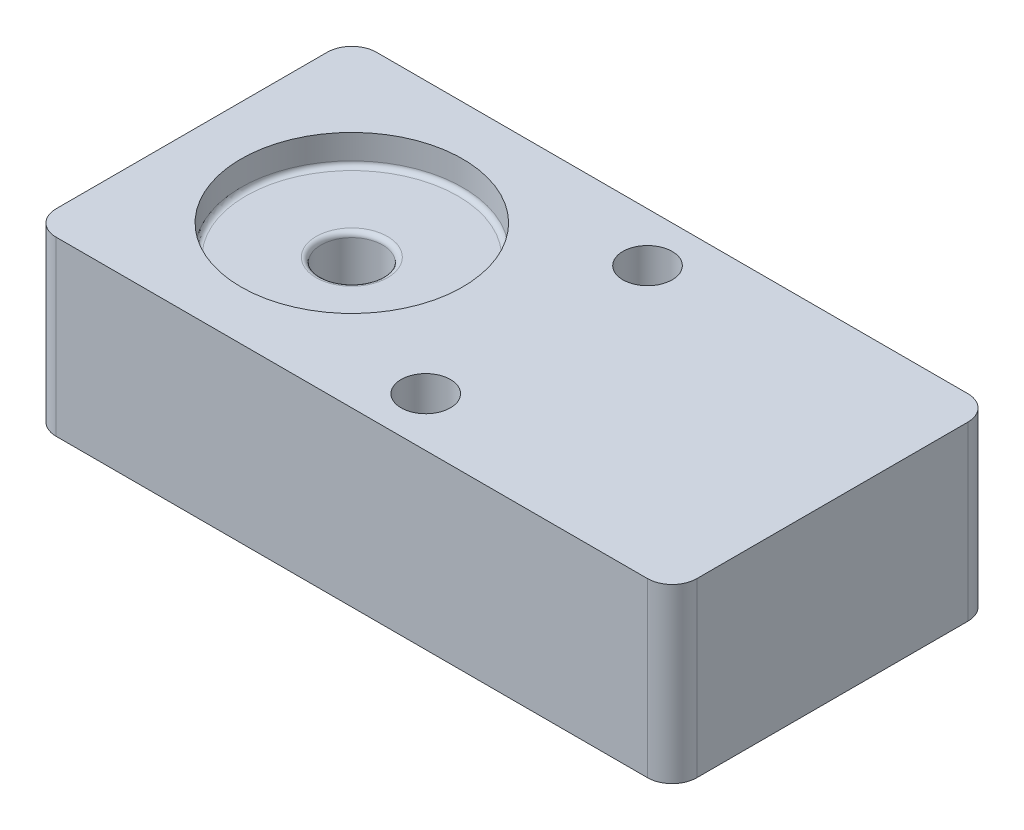
ISO-10303-21;
HEADER;
FILE_DESCRIPTION(('STEP AP214'),'2;1');
FILE_NAME('part.step','',(''),(''),'','','');
FILE_SCHEMA(('AUTOMOTIVE_DESIGN { 1 0 10303 214 1 1 1 1 }'));
ENDSEC;
DATA;
#1=APPLICATION_CONTEXT('core data for automotive mechanical design processes');
#2=APPLICATION_PROTOCOL_DEFINITION('international standard','automotive_design',2000,#1);
#3=PRODUCT_CONTEXT('',#1,'mechanical');
#4=PRODUCT('Part','Part','',(#3));
#5=PRODUCT_RELATED_PRODUCT_CATEGORY('part','',(#4));
#6=PRODUCT_DEFINITION_FORMATION('','',#4);
#7=PRODUCT_DEFINITION_CONTEXT('part definition',#1,'design');
#8=PRODUCT_DEFINITION('design','',#6,#7);
#9=PRODUCT_DEFINITION_SHAPE('','',#8);
#10=(LENGTH_UNIT() NAMED_UNIT(*) SI_UNIT(.MILLI.,.METRE.));
#11=(NAMED_UNIT(*) PLANE_ANGLE_UNIT() SI_UNIT($,.RADIAN.));
#12=(NAMED_UNIT(*) SI_UNIT($,.STERADIAN.) SOLID_ANGLE_UNIT());
#13=UNCERTAINTY_MEASURE_WITH_UNIT(LENGTH_MEASURE(1.E-05),#10,'distance_accuracy_value','');
#14=(GEOMETRIC_REPRESENTATION_CONTEXT(3) GLOBAL_UNCERTAINTY_ASSIGNED_CONTEXT((#13)) GLOBAL_UNIT_ASSIGNED_CONTEXT((#10,
#11,#12)) REPRESENTATION_CONTEXT('',''));
#15=CARTESIAN_POINT('',(0.,0.,0.));
#16=DIRECTION('',(0.,0.,1.));
#17=DIRECTION('',(1.,0.,0.));
#18=AXIS2_PLACEMENT_3D('',#15,#16,#17);
#19=CARTESIAN_POINT('',(120.,70.,-55.));
#20=DIRECTION('',(0.,-1.,0.));
#21=DIRECTION('',(0.,0.,-1.));
#22=AXIS2_PLACEMENT_3D('',#19,#20,#21);
#23=CYLINDRICAL_SURFACE('',#22,10.);
#24=DIRECTION('',(0.,-1.,0.));
#25=VECTOR('',#24,1.);
#26=CARTESIAN_POINT('',(120.,70.,-65.));
#27=LINE('',#26,#25);
#28=CARTESIAN_POINT('',(120.,70.,-65.));
#29=VERTEX_POINT('',#28);
#30=CARTESIAN_POINT('',(120.,0.,-65.));
#31=VERTEX_POINT('',#30);
#32=EDGE_CURVE('E100',#29,#31,#27,.T.);
#33=ORIENTED_EDGE('',*,*,#32,.F.);
#34=CARTESIAN_POINT('',(120.,70.,-55.));
#35=DIRECTION('',(0.,1.,0.));
#36=DIRECTION('',(0.,0.,1.));
#37=AXIS2_PLACEMENT_3D('',#34,#35,#36);
#38=CIRCLE('',#37,10.);
#39=CARTESIAN_POINT('',(130.,70.,-55.));
#40=VERTEX_POINT('',#39);
#41=EDGE_CURVE('E39',#40,#29,#38,.T.);
#42=ORIENTED_EDGE('',*,*,#41,.F.);
#43=DIRECTION('',(0.,-1.,0.));
#44=VECTOR('',#43,1.);
#45=CARTESIAN_POINT('',(130.,70.,-55.));
#46=LINE('',#45,#44);
#47=CARTESIAN_POINT('',(130.,0.,-55.));
#48=VERTEX_POINT('',#47);
#49=EDGE_CURVE('E147',#48,#40,#46,.F.);
#50=ORIENTED_EDGE('',*,*,#49,.F.);
#51=CARTESIAN_POINT('',(120.,0.,-55.));
#52=DIRECTION('',(0.,1.,0.));
#53=DIRECTION('',(0.,0.,1.));
#54=AXIS2_PLACEMENT_3D('',#51,#52,#53);
#55=CIRCLE('',#54,10.);
#56=EDGE_CURVE('E11',#31,#48,#55,.F.);
#57=ORIENTED_EDGE('',*,*,#56,.F.);
#58=EDGE_LOOP('',(#33,#42,#50,#57));
#59=FACE_BOUND('',#58,.T.);
#60=ADVANCED_FACE('F32',(#59),#23,.T.);
#61=CARTESIAN_POINT('',(120.,70.,55.));
#62=DIRECTION('',(0.,-1.,0.));
#63=DIRECTION('',(0.,0.,-1.));
#64=AXIS2_PLACEMENT_3D('',#61,#62,#63);
#65=CYLINDRICAL_SURFACE('',#64,10.);
#66=DIRECTION('',(0.,-1.,0.));
#67=VECTOR('',#66,1.);
#68=CARTESIAN_POINT('',(130.,70.,55.));
#69=LINE('',#68,#67);
#70=CARTESIAN_POINT('',(130.,70.,55.));
#71=VERTEX_POINT('',#70);
#72=CARTESIAN_POINT('',(130.,0.,55.));
#73=VERTEX_POINT('',#72);
#74=EDGE_CURVE('E136',#71,#73,#69,.T.);
#75=ORIENTED_EDGE('',*,*,#74,.F.);
#76=CARTESIAN_POINT('',(120.,70.,55.));
#77=DIRECTION('',(0.,1.,0.));
#78=DIRECTION('',(0.,0.,1.));
#79=AXIS2_PLACEMENT_3D('',#76,#77,#78);
#80=CIRCLE('',#79,10.);
#81=CARTESIAN_POINT('',(120.,70.,65.));
#82=VERTEX_POINT('',#81);
#83=EDGE_CURVE('E142',#82,#71,#80,.T.);
#84=ORIENTED_EDGE('',*,*,#83,.F.);
#85=DIRECTION('',(0.,-1.,0.));
#86=VECTOR('',#85,1.);
#87=CARTESIAN_POINT('',(120.,70.,65.));
#88=LINE('',#87,#86);
#89=CARTESIAN_POINT('',(120.,0.,65.));
#90=VERTEX_POINT('',#89);
#91=EDGE_CURVE('E139',#90,#82,#88,.F.);
#92=ORIENTED_EDGE('',*,*,#91,.F.);
#93=CARTESIAN_POINT('',(120.,0.,55.));
#94=DIRECTION('',(0.,1.,0.));
#95=DIRECTION('',(0.,0.,1.));
#96=AXIS2_PLACEMENT_3D('',#93,#94,#95);
#97=CIRCLE('',#96,10.);
#98=EDGE_CURVE('E144',#73,#90,#97,.F.);
#99=ORIENTED_EDGE('',*,*,#98,.F.);
#100=EDGE_LOOP('',(#75,#84,#92,#99));
#101=FACE_BOUND('',#100,.T.);
#102=ADVANCED_FACE('F200',(#101),#65,.T.);
#103=CARTESIAN_POINT('',(-120.,70.,55.));
#104=DIRECTION('',(0.,1.,0.));
#105=DIRECTION('',(0.,0.,1.));
#106=AXIS2_PLACEMENT_3D('',#103,#104,#105);
#107=CYLINDRICAL_SURFACE('',#106,10.);
#108=DIRECTION('',(0.,1.,0.));
#109=VECTOR('',#108,1.);
#110=CARTESIAN_POINT('',(-130.,70.,55.));
#111=LINE('',#110,#109);
#112=CARTESIAN_POINT('',(-130.,0.,55.));
#113=VERTEX_POINT('',#112);
#114=CARTESIAN_POINT('',(-130.,70.,55.));
#115=VERTEX_POINT('',#114);
#116=EDGE_CURVE('E126',#113,#115,#111,.T.);
#117=ORIENTED_EDGE('',*,*,#116,.F.);
#118=CARTESIAN_POINT('',(-120.,0.,55.));
#119=DIRECTION('',(0.,1.,0.));
#120=DIRECTION('',(0.,0.,1.));
#121=AXIS2_PLACEMENT_3D('',#118,#119,#120);
#122=CIRCLE('',#121,10.);
#123=CARTESIAN_POINT('',(-120.,0.,65.));
#124=VERTEX_POINT('',#123);
#125=EDGE_CURVE('E132',#124,#113,#122,.F.);
#126=ORIENTED_EDGE('',*,*,#125,.F.);
#127=DIRECTION('',(0.,1.,0.));
#128=VECTOR('',#127,1.);
#129=CARTESIAN_POINT('',(-120.,70.,65.));
#130=LINE('',#129,#128);
#131=CARTESIAN_POINT('',(-120.,70.,65.));
#132=VERTEX_POINT('',#131);
#133=EDGE_CURVE('E129',#132,#124,#130,.F.);
#134=ORIENTED_EDGE('',*,*,#133,.F.);
#135=CARTESIAN_POINT('',(-120.,70.,55.));
#136=DIRECTION('',(0.,1.,0.));
#137=DIRECTION('',(0.,0.,1.));
#138=AXIS2_PLACEMENT_3D('',#135,#136,#137);
#139=CIRCLE('',#138,10.);
#140=EDGE_CURVE('E134',#115,#132,#139,.T.);
#141=ORIENTED_EDGE('',*,*,#140,.F.);
#142=EDGE_LOOP('',(#117,#126,#134,#141));
#143=FACE_BOUND('',#142,.T.);
#144=ADVANCED_FACE('F204',(#143),#107,.T.);
#145=CARTESIAN_POINT('',(-120.,70.,-55.));
#146=DIRECTION('',(0.,1.,0.));
#147=DIRECTION('',(0.,0.,1.));
#148=AXIS2_PLACEMENT_3D('',#145,#146,#147);
#149=CYLINDRICAL_SURFACE('',#148,10.);
#150=DIRECTION('',(0.,1.,0.));
#151=VECTOR('',#150,1.);
#152=CARTESIAN_POINT('',(-120.,70.,-65.));
#153=LINE('',#152,#151);
#154=CARTESIAN_POINT('',(-120.,0.,-65.));
#155=VERTEX_POINT('',#154);
#156=CARTESIAN_POINT('',(-120.,70.,-65.));
#157=VERTEX_POINT('',#156);
#158=EDGE_CURVE('E99',#155,#157,#153,.T.);
#159=ORIENTED_EDGE('',*,*,#158,.F.);
#160=CARTESIAN_POINT('',(-120.,0.,-55.));
#161=DIRECTION('',(0.,1.,0.));
#162=DIRECTION('',(0.,0.,1.));
#163=AXIS2_PLACEMENT_3D('',#160,#161,#162);
#164=CIRCLE('',#163,10.);
#165=CARTESIAN_POINT('',(-130.,0.,-55.));
#166=VERTEX_POINT('',#165);
#167=EDGE_CURVE('E105',#166,#155,#164,.F.);
#168=ORIENTED_EDGE('',*,*,#167,.F.);
#169=DIRECTION('',(0.,1.,0.));
#170=VECTOR('',#169,1.);
#171=CARTESIAN_POINT('',(-130.,70.,-55.));
#172=LINE('',#171,#170);
#173=CARTESIAN_POINT('',(-130.,70.,-55.));
#174=VERTEX_POINT('',#173);
#175=EDGE_CURVE('E113',#174,#166,#172,.F.);
#176=ORIENTED_EDGE('',*,*,#175,.F.);
#177=CARTESIAN_POINT('',(-120.,70.,-55.));
#178=DIRECTION('',(0.,1.,0.));
#179=DIRECTION('',(0.,0.,1.));
#180=AXIS2_PLACEMENT_3D('',#177,#178,#179);
#181=CIRCLE('',#180,10.);
#182=EDGE_CURVE('E112',#157,#174,#181,.T.);
#183=ORIENTED_EDGE('',*,*,#182,.F.);
#184=EDGE_LOOP('',(#159,#168,#176,#183));
#185=FACE_BOUND('',#184,.T.);
#186=ADVANCED_FACE('F116',(#185),#149,.T.);
#187=CARTESIAN_POINT('',(-130.,70.,65.));
#188=DIRECTION('',(1.,0.,0.));
#189=DIRECTION('',(0.,0.,-1.));
#190=AXIS2_PLACEMENT_3D('',#187,#188,#189);
#191=PLANE('',#190);
#192=DIRECTION('',(0.,0.,1.));
#193=VECTOR('',#192,1.);
#194=CARTESIAN_POINT('',(-130.,0.,65.));
#195=LINE('',#194,#193);
#196=EDGE_CURVE('E108',#166,#113,#195,.T.);
#197=ORIENTED_EDGE('',*,*,#196,.T.);
#198=ORIENTED_EDGE('',*,*,#116,.T.);
#199=DIRECTION('',(0.,0.,1.));
#200=VECTOR('',#199,1.);
#201=CARTESIAN_POINT('',(-130.,70.,65.));
#202=LINE('',#201,#200);
#203=EDGE_CURVE('E101',#174,#115,#202,.T.);
#204=ORIENTED_EDGE('',*,*,#203,.F.);
#205=ORIENTED_EDGE('',*,*,#175,.T.);
#206=EDGE_LOOP('',(#197,#198,#204,#205));
#207=FACE_BOUND('',#206,.T.);
#208=ADVANCED_FACE('F213',(#207),#191,.F.);
#209=CARTESIAN_POINT('',(130.,70.,65.));
#210=DIRECTION('',(0.,0.,-1.));
#211=DIRECTION('',(-1.,0.,0.));
#212=AXIS2_PLACEMENT_3D('',#209,#210,#211);
#213=PLANE('',#212);
#214=DIRECTION('',(1.,0.,0.));
#215=VECTOR('',#214,1.);
#216=CARTESIAN_POINT('',(130.,0.,65.));
#217=LINE('',#216,#215);
#218=EDGE_CURVE('E164',#124,#90,#217,.T.);
#219=ORIENTED_EDGE('',*,*,#218,.T.);
#220=ORIENTED_EDGE('',*,*,#91,.T.);
#221=DIRECTION('',(1.,0.,0.));
#222=VECTOR('',#221,1.);
#223=CARTESIAN_POINT('',(130.,70.,65.));
#224=LINE('',#223,#222);
#225=EDGE_CURVE('E159',#132,#82,#224,.T.);
#226=ORIENTED_EDGE('',*,*,#225,.F.);
#227=ORIENTED_EDGE('',*,*,#133,.T.);
#228=EDGE_LOOP('',(#219,#220,#226,#227));
#229=FACE_BOUND('',#228,.T.);
#230=ADVANCED_FACE('F217',(#229),#213,.F.);
#231=CARTESIAN_POINT('',(130.,70.,65.));
#232=DIRECTION('',(-1.,0.,0.));
#233=DIRECTION('',(0.,0.,1.));
#234=AXIS2_PLACEMENT_3D('',#231,#232,#233);
#235=PLANE('',#234);
#236=DIRECTION('',(0.,0.,-1.));
#237=VECTOR('',#236,1.);
#238=CARTESIAN_POINT('',(130.,0.,65.));
#239=LINE('',#238,#237);
#240=EDGE_CURVE('E102',#73,#48,#239,.T.);
#241=ORIENTED_EDGE('',*,*,#240,.T.);
#242=ORIENTED_EDGE('',*,*,#49,.T.);
#243=DIRECTION('',(0.,0.,-1.));
#244=VECTOR('',#243,1.);
#245=CARTESIAN_POINT('',(130.,70.,65.));
#246=LINE('',#245,#244);
#247=EDGE_CURVE('E153',#71,#40,#246,.T.);
#248=ORIENTED_EDGE('',*,*,#247,.F.);
#249=ORIENTED_EDGE('',*,*,#74,.T.);
#250=EDGE_LOOP('',(#241,#242,#248,#249));
#251=FACE_BOUND('',#250,.T.);
#252=ADVANCED_FACE('F223',(#251),#235,.F.);
#253=CARTESIAN_POINT('',(130.,70.,-65.));
#254=DIRECTION('',(0.,0.,1.));
#255=DIRECTION('',(1.,0.,0.));
#256=AXIS2_PLACEMENT_3D('',#253,#254,#255);
#257=PLANE('',#256);
#258=DIRECTION('',(-1.,0.,0.));
#259=VECTOR('',#258,1.);
#260=CARTESIAN_POINT('',(130.,70.,-65.));
#261=LINE('',#260,#259);
#262=EDGE_CURVE('E151',#29,#157,#261,.T.);
#263=ORIENTED_EDGE('',*,*,#262,.F.);
#264=ORIENTED_EDGE('',*,*,#32,.T.);
#265=DIRECTION('',(-1.,0.,0.));
#266=VECTOR('',#265,1.);
#267=CARTESIAN_POINT('',(130.,0.,-65.));
#268=LINE('',#267,#266);
#269=EDGE_CURVE('E94',#31,#155,#268,.T.);
#270=ORIENTED_EDGE('',*,*,#269,.T.);
#271=ORIENTED_EDGE('',*,*,#158,.T.);
#272=EDGE_LOOP('',(#263,#264,#270,#271));
#273=FACE_BOUND('',#272,.T.);
#274=ADVANCED_FACE('F97',(#273),#257,.F.);
#275=CARTESIAN_POINT('',(0.,70.,0.));
#276=DIRECTION('',(0.,1.,0.));
#277=DIRECTION('',(0.,0.,1.));
#278=AXIS2_PLACEMENT_3D('',#275,#276,#277);
#279=PLANE('',#278);
#280=CARTESIAN_POINT('',(9.99999999999545,70.,-44.9999999999938));
#281=DIRECTION('',(0.,1.,0.));
#282=DIRECTION('',(0.,0.,1.));
#283=AXIS2_PLACEMENT_3D('',#280,#281,#282);
#284=CIRCLE('',#283,10.);
#285=CARTESIAN_POINT('',(9.99999999999545,70.,-34.9999999999938));
#286=VERTEX_POINT('',#285);
#287=EDGE_CURVE('E256',#286,#286,#284,.T.);
#288=ORIENTED_EDGE('',*,*,#287,.F.);
#289=EDGE_LOOP('',(#288));
#290=FACE_BOUND('',#289,.T.);
#291=CARTESIAN_POINT('',(9.99999999999545,70.,44.9999999999938));
#292=DIRECTION('',(0.,1.,0.));
#293=DIRECTION('',(0.,0.,-1.));
#294=AXIS2_PLACEMENT_3D('',#291,#292,#293);
#295=CIRCLE('',#294,10.);
#296=CARTESIAN_POINT('',(9.99999999999545,70.,34.9999999999938));
#297=VERTEX_POINT('',#296);
#298=EDGE_CURVE('E260',#297,#297,#295,.T.);
#299=ORIENTED_EDGE('',*,*,#298,.F.);
#300=EDGE_LOOP('',(#299));
#301=FACE_BOUND('',#300,.T.);
#302=CARTESIAN_POINT('',(-65.0000000000001,70.,0.));
#303=DIRECTION('',(0.,1.,0.));
#304=DIRECTION('',(0.,0.,1.));
#305=AXIS2_PLACEMENT_3D('',#302,#303,#304);
#306=CIRCLE('',#305,45.);
#307=CARTESIAN_POINT('',(-65.0000000000001,70.,45.));
#308=VERTEX_POINT('',#307);
#309=EDGE_CURVE('E165',#308,#308,#306,.T.);
#310=ORIENTED_EDGE('',*,*,#309,.F.);
#311=EDGE_LOOP('',(#310));
#312=FACE_BOUND('',#311,.T.);
#313=ORIENTED_EDGE('',*,*,#247,.T.);
#314=ORIENTED_EDGE('',*,*,#41,.T.);
#315=ORIENTED_EDGE('',*,*,#262,.T.);
#316=ORIENTED_EDGE('',*,*,#182,.T.);
#317=ORIENTED_EDGE('',*,*,#203,.T.);
#318=ORIENTED_EDGE('',*,*,#140,.T.);
#319=ORIENTED_EDGE('',*,*,#225,.T.);
#320=ORIENTED_EDGE('',*,*,#83,.T.);
#321=EDGE_LOOP('',(#313,#314,#315,#316,#317,#318,#319,#320));
#322=FACE_BOUND('',#321,.T.);
#323=ADVANCED_FACE('F150',(#290,#301,#312,#322),#279,.T.);
#324=CARTESIAN_POINT('',(0.,0.,0.));
#325=DIRECTION('',(0.,1.,0.));
#326=DIRECTION('',(0.,0.,1.));
#327=AXIS2_PLACEMENT_3D('',#324,#325,#326);
#328=PLANE('',#327);
#329=CARTESIAN_POINT('',(9.99999999999545,0.,-44.9999999999938));
#330=DIRECTION('',(0.,1.,0.));
#331=DIRECTION('',(0.,0.,1.));
#332=AXIS2_PLACEMENT_3D('',#329,#330,#331);
#333=CIRCLE('',#332,10.);
#334=CARTESIAN_POINT('',(9.99999999999545,0.,-34.9999999999938));
#335=VERTEX_POINT('',#334);
#336=EDGE_CURVE('E253',#335,#335,#333,.T.);
#337=ORIENTED_EDGE('',*,*,#336,.T.);
#338=EDGE_LOOP('',(#337));
#339=FACE_BOUND('',#338,.T.);
#340=CARTESIAN_POINT('',(9.99999999999545,0.,44.9999999999938));
#341=DIRECTION('',(0.,1.,0.));
#342=DIRECTION('',(0.,0.,-1.));
#343=AXIS2_PLACEMENT_3D('',#340,#341,#342);
#344=CIRCLE('',#343,10.);
#345=CARTESIAN_POINT('',(9.99999999999545,0.,34.9999999999938));
#346=VERTEX_POINT('',#345);
#347=EDGE_CURVE('E293',#346,#346,#344,.T.);
#348=ORIENTED_EDGE('',*,*,#347,.T.);
#349=EDGE_LOOP('',(#348));
#350=FACE_BOUND('',#349,.T.);
#351=ORIENTED_EDGE('',*,*,#269,.F.);
#352=ORIENTED_EDGE('',*,*,#56,.T.);
#353=ORIENTED_EDGE('',*,*,#240,.F.);
#354=ORIENTED_EDGE('',*,*,#98,.T.);
#355=ORIENTED_EDGE('',*,*,#218,.F.);
#356=ORIENTED_EDGE('',*,*,#125,.T.);
#357=ORIENTED_EDGE('',*,*,#196,.F.);
#358=ORIENTED_EDGE('',*,*,#167,.T.);
#359=EDGE_LOOP('',(#351,#352,#353,#354,#355,#356,#357,#358));
#360=FACE_BOUND('',#359,.T.);
#361=ADVANCED_FACE('F106',(#339,#350,#360),#328,.F.);
#362=CARTESIAN_POINT('',(-65.0000000000001,58.,0.));
#363=DIRECTION('',(0.,1.,0.));
#364=DIRECTION('',(0.,0.,1.));
#365=AXIS2_PLACEMENT_3D('',#362,#363,#364);
#366=CYLINDRICAL_SURFACE('',#365,45.);
#367=CARTESIAN_POINT('',(-65.0000000000001,60.,0.));
#368=DIRECTION('',(0.,1.,0.));
#369=DIRECTION('',(0.,0.,1.));
#370=AXIS2_PLACEMENT_3D('',#367,#368,#369);
#371=CIRCLE('',#370,45.);
#372=CARTESIAN_POINT('',(-65.0000000000001,60.,45.));
#373=VERTEX_POINT('',#372);
#374=EDGE_CURVE('E157',#373,#373,#371,.F.);
#375=ORIENTED_EDGE('',*,*,#374,.T.);
#376=EDGE_LOOP('',(#375));
#377=FACE_BOUND('',#376,.T.);
#378=ORIENTED_EDGE('',*,*,#309,.T.);
#379=EDGE_LOOP('',(#378));
#380=FACE_BOUND('',#379,.T.);
#381=ADVANCED_FACE('F239',(#377,#380),#366,.F.);
#382=CARTESIAN_POINT('',(-65.0000000000001,58.,0.));
#383=DIRECTION('',(0.,1.,0.));
#384=DIRECTION('',(0.,0.,1.));
#385=AXIS2_PLACEMENT_3D('',#382,#383,#384);
#386=PLANE('',#385);
#387=CARTESIAN_POINT('',(-65.0000000000001,58.,0.));
#388=DIRECTION('',(0.,1.,0.));
#389=DIRECTION('',(0.,0.,1.));
#390=AXIS2_PLACEMENT_3D('',#387,#388,#389);
#391=CIRCLE('',#390,14.5);
#392=CARTESIAN_POINT('',(-65.0000000000001,58.,14.5));
#393=VERTEX_POINT('',#392);
#394=EDGE_CURVE('E175',#393,#393,#391,.F.);
#395=ORIENTED_EDGE('',*,*,#394,.T.);
#396=EDGE_LOOP('',(#395));
#397=FACE_BOUND('',#396,.T.);
#398=CARTESIAN_POINT('',(-65.0000000000001,58.,0.));
#399=DIRECTION('',(0.,1.,0.));
#400=DIRECTION('',(0.,0.,1.));
#401=AXIS2_PLACEMENT_3D('',#398,#399,#400);
#402=CIRCLE('',#401,43.);
#403=CARTESIAN_POINT('',(-65.0000000000001,58.,43.));
#404=VERTEX_POINT('',#403);
#405=EDGE_CURVE('E154',#404,#404,#402,.T.);
#406=ORIENTED_EDGE('',*,*,#405,.T.);
#407=EDGE_LOOP('',(#406));
#408=FACE_BOUND('',#407,.T.);
#409=ADVANCED_FACE('F231',(#397,#408),#386,.T.);
#410=CARTESIAN_POINT('',(-65.0000000000001,60.,0.));
#411=DIRECTION('',(0.,1.,0.));
#412=DIRECTION('',(0.,0.,1.));
#413=AXIS2_PLACEMENT_3D('',#410,#411,#412);
#414=TOROIDAL_SURFACE('',#413,43.,2.);
#415=ORIENTED_EDGE('',*,*,#374,.F.);
#416=EDGE_LOOP('',(#415));
#417=FACE_BOUND('',#416,.T.);
#418=ORIENTED_EDGE('',*,*,#405,.F.);
#419=EDGE_LOOP('',(#418));
#420=FACE_BOUND('',#419,.T.);
#421=ADVANCED_FACE('F228',(#417,#420),#414,.F.);
#422=CARTESIAN_POINT('',(-65.0000000000001,20.,0.));
#423=DIRECTION('',(0.,1.,0.));
#424=DIRECTION('',(0.,0.,1.));
#425=AXIS2_PLACEMENT_3D('',#422,#423,#424);
#426=CYLINDRICAL_SURFACE('',#425,12.5);
#427=CARTESIAN_POINT('',(-65.0000000000001,22.,0.));
#428=DIRECTION('',(0.,1.,0.));
#429=DIRECTION('',(0.,0.,1.));
#430=AXIS2_PLACEMENT_3D('',#427,#428,#429);
#431=CIRCLE('',#430,12.5);
#432=CARTESIAN_POINT('',(-65.0000000000001,22.,12.5));
#433=VERTEX_POINT('',#432);
#434=EDGE_CURVE('E117',#433,#433,#431,.F.);
#435=ORIENTED_EDGE('',*,*,#434,.T.);
#436=EDGE_LOOP('',(#435));
#437=FACE_BOUND('',#436,.T.);
#438=CARTESIAN_POINT('',(-65.0000000000001,56.,0.));
#439=DIRECTION('',(0.,1.,0.));
#440=DIRECTION('',(0.,0.,1.));
#441=AXIS2_PLACEMENT_3D('',#438,#439,#440);
#442=CIRCLE('',#441,12.5);
#443=CARTESIAN_POINT('',(-65.0000000000001,56.,12.5));
#444=VERTEX_POINT('',#443);
#445=EDGE_CURVE('E172',#444,#444,#442,.T.);
#446=ORIENTED_EDGE('',*,*,#445,.T.);
#447=EDGE_LOOP('',(#446));
#448=FACE_BOUND('',#447,.T.);
#449=ADVANCED_FACE('F230',(#437,#448),#426,.F.);
#450=CARTESIAN_POINT('',(-65.0000000000001,20.,0.));
#451=DIRECTION('',(0.,1.,0.));
#452=DIRECTION('',(0.,0.,1.));
#453=AXIS2_PLACEMENT_3D('',#450,#451,#452);
#454=PLANE('',#453);
#455=CARTESIAN_POINT('',(-65.0000000000001,20.,0.));
#456=DIRECTION('',(0.,1.,0.));
#457=DIRECTION('',(0.,0.,1.));
#458=AXIS2_PLACEMENT_3D('',#455,#456,#457);
#459=CIRCLE('',#458,10.5);
#460=CARTESIAN_POINT('',(-65.0000000000001,20.,10.5));
#461=VERTEX_POINT('',#460);
#462=EDGE_CURVE('E121',#461,#461,#459,.T.);
#463=ORIENTED_EDGE('',*,*,#462,.T.);
#464=EDGE_LOOP('',(#463));
#465=FACE_BOUND('',#464,.T.);
#466=ADVANCED_FACE('F180',(#465),#454,.T.);
#467=CARTESIAN_POINT('',(-65.0000000000001,56.,0.));
#468=DIRECTION('',(0.,1.,0.));
#469=DIRECTION('',(0.,0.,1.));
#470=AXIS2_PLACEMENT_3D('',#467,#468,#469);
#471=TOROIDAL_SURFACE('',#470,14.5,2.);
#472=ORIENTED_EDGE('',*,*,#394,.F.);
#473=EDGE_LOOP('',(#472));
#474=FACE_BOUND('',#473,.T.);
#475=ORIENTED_EDGE('',*,*,#445,.F.);
#476=EDGE_LOOP('',(#475));
#477=FACE_BOUND('',#476,.T.);
#478=ADVANCED_FACE('F185',(#474,#477),#471,.T.);
#479=CARTESIAN_POINT('',(-65.0000000000001,22.,0.));
#480=DIRECTION('',(0.,1.,0.));
#481=DIRECTION('',(0.,0.,1.));
#482=AXIS2_PLACEMENT_3D('',#479,#480,#481);
#483=TOROIDAL_SURFACE('',#482,10.5,2.);
#484=ORIENTED_EDGE('',*,*,#434,.F.);
#485=EDGE_LOOP('',(#484));
#486=FACE_BOUND('',#485,.T.);
#487=ORIENTED_EDGE('',*,*,#462,.F.);
#488=EDGE_LOOP('',(#487));
#489=FACE_BOUND('',#488,.T.);
#490=ADVANCED_FACE('F182',(#486,#489),#483,.F.);
#491=CARTESIAN_POINT('',(9.99999999999545,0.,44.9999999999938));
#492=DIRECTION('',(0.,1.,0.));
#493=DIRECTION('',(0.,0.,1.));
#494=AXIS2_PLACEMENT_3D('',#491,#492,#493);
#495=CYLINDRICAL_SURFACE('',#494,10.);
#496=ORIENTED_EDGE('',*,*,#347,.F.);
#497=EDGE_LOOP('',(#496));
#498=FACE_BOUND('',#497,.T.);
#499=ORIENTED_EDGE('',*,*,#298,.T.);
#500=EDGE_LOOP('',(#499));
#501=FACE_BOUND('',#500,.T.);
#502=ADVANCED_FACE('F184',(#498,#501),#495,.F.);
#503=CARTESIAN_POINT('',(9.99999999999545,0.,-44.9999999999938));
#504=DIRECTION('',(0.,1.,0.));
#505=DIRECTION('',(0.,0.,1.));
#506=AXIS2_PLACEMENT_3D('',#503,#504,#505);
#507=CYLINDRICAL_SURFACE('',#506,10.);
#508=ORIENTED_EDGE('',*,*,#336,.F.);
#509=EDGE_LOOP('',(#508));
#510=FACE_BOUND('',#509,.T.);
#511=ORIENTED_EDGE('',*,*,#287,.T.);
#512=EDGE_LOOP('',(#511));
#513=FACE_BOUND('',#512,.T.);
#514=ADVANCED_FACE('F192',(#510,#513),#507,.F.);
#515=CLOSED_SHELL('',(#60,#102,#144,#186,#208,#230,#252,#274,#323,#361,#381,#409,#421,#449,#466,
#478,#490,#502,#514));
#516=MANIFOLD_SOLID_BREP('B2',#515);
#517=ADVANCED_BREP_SHAPE_REPRESENTATION('',(#18,#516),#14);
#518=SHAPE_DEFINITION_REPRESENTATION(#9,#517);
ENDSEC;
END-ISO-10303-21;
